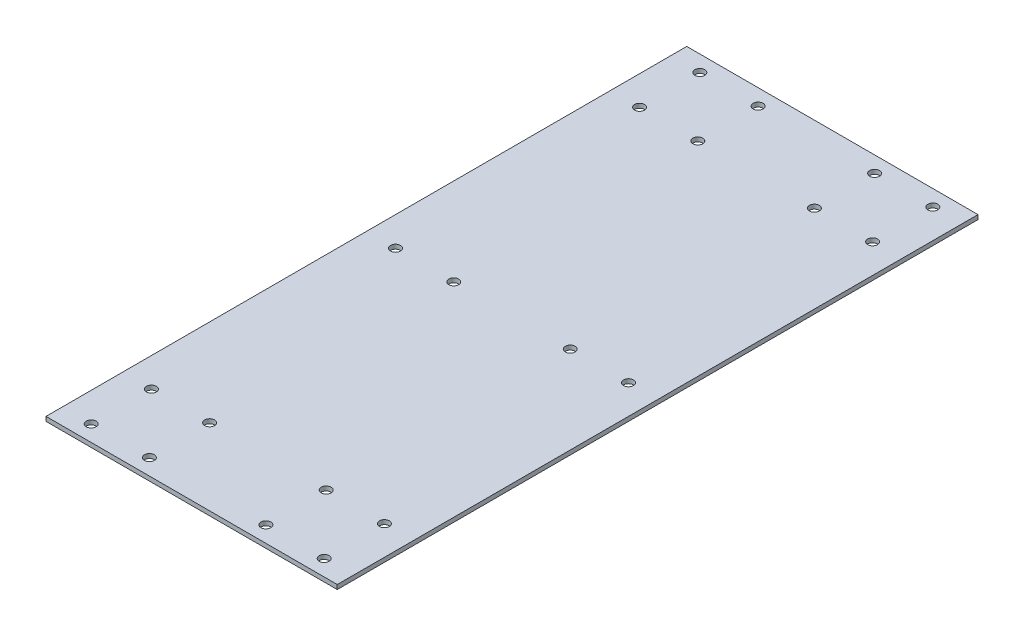
ISO-10303-21;
HEADER;
FILE_DESCRIPTION(('STEP AP214'),'2;1');
FILE_NAME('part.step','',(''),(''),'','','');
FILE_SCHEMA(('AUTOMOTIVE_DESIGN { 1 0 10303 214 1 1 1 1 }'));
ENDSEC;
DATA;
#1=APPLICATION_CONTEXT('core data for automotive mechanical design processes');
#2=APPLICATION_PROTOCOL_DEFINITION('international standard','automotive_design',2000,#1);
#3=PRODUCT_CONTEXT('',#1,'mechanical');
#4=PRODUCT('Part','Part','',(#3));
#5=PRODUCT_RELATED_PRODUCT_CATEGORY('part','',(#4));
#6=PRODUCT_DEFINITION_FORMATION('','',#4);
#7=PRODUCT_DEFINITION_CONTEXT('part definition',#1,'design');
#8=PRODUCT_DEFINITION('design','',#6,#7);
#9=PRODUCT_DEFINITION_SHAPE('','',#8);
#10=(LENGTH_UNIT() NAMED_UNIT(*) SI_UNIT(.MILLI.,.METRE.));
#11=(NAMED_UNIT(*) PLANE_ANGLE_UNIT() SI_UNIT($,.RADIAN.));
#12=(NAMED_UNIT(*) SI_UNIT($,.STERADIAN.) SOLID_ANGLE_UNIT());
#13=UNCERTAINTY_MEASURE_WITH_UNIT(LENGTH_MEASURE(1.E-05),#10,'distance_accuracy_value','');
#14=(GEOMETRIC_REPRESENTATION_CONTEXT(3) GLOBAL_UNCERTAINTY_ASSIGNED_CONTEXT((#13)) GLOBAL_UNIT_ASSIGNED_CONTEXT((#10,
#11,#12)) REPRESENTATION_CONTEXT('',''));
#15=CARTESIAN_POINT('',(0.,0.,0.));
#16=DIRECTION('',(0.,0.,1.));
#17=DIRECTION('',(1.,0.,0.));
#18=AXIS2_PLACEMENT_3D('',#15,#16,#17);
#19=CARTESIAN_POINT('',(-50.,46.95,-168.5));
#20=DIRECTION('',(-1.,0.,0.));
#21=DIRECTION('',(0.,0.,1.));
#22=AXIS2_PLACEMENT_3D('',#19,#20,#21);
#23=PLANE('',#22);
#24=DIRECTION('',(0.,-1.,0.));
#25=VECTOR('',#24,1.);
#26=CARTESIAN_POINT('',(-50.,46.95,51.5));
#27=LINE('',#26,#25);
#28=CARTESIAN_POINT('',(-50.,46.95,51.5));
#29=VERTEX_POINT('',#28);
#30=CARTESIAN_POINT('',(-50.,45.45,51.5));
#31=VERTEX_POINT('',#30);
#32=EDGE_CURVE('E87',#29,#31,#27,.T.);
#33=ORIENTED_EDGE('',*,*,#32,.F.);
#34=DIRECTION('',(0.,0.,1.));
#35=VECTOR('',#34,1.);
#36=CARTESIAN_POINT('',(-50.,46.95,-168.5));
#37=LINE('',#36,#35);
#38=CARTESIAN_POINT('',(-50.,46.95,-168.5));
#39=VERTEX_POINT('',#38);
#40=EDGE_CURVE('E59',#39,#29,#37,.T.);
#41=ORIENTED_EDGE('',*,*,#40,.F.);
#42=DIRECTION('',(0.,-1.,0.));
#43=VECTOR('',#42,1.);
#44=CARTESIAN_POINT('',(-50.,46.95,-168.5));
#45=LINE('',#44,#43);
#46=CARTESIAN_POINT('',(-50.,45.45,-168.5));
#47=VERTEX_POINT('',#46);
#48=EDGE_CURVE('E72',#39,#47,#45,.T.);
#49=ORIENTED_EDGE('',*,*,#48,.T.);
#50=DIRECTION('',(0.,0.,1.));
#51=VECTOR('',#50,1.);
#52=CARTESIAN_POINT('',(-50.,45.45,-168.5));
#53=LINE('',#52,#51);
#54=EDGE_CURVE('E11',#47,#31,#53,.T.);
#55=ORIENTED_EDGE('',*,*,#54,.T.);
#56=EDGE_LOOP('',(#33,#41,#49,#55));
#57=FACE_BOUND('',#56,.T.);
#58=ADVANCED_FACE('F17',(#57),#23,.T.);
#59=CARTESIAN_POINT('',(-46.3303607703069,45.45,-168.5));
#60=DIRECTION('',(0.,-1.,0.));
#61=DIRECTION('',(0.,0.,-1.));
#62=AXIS2_PLACEMENT_3D('',#59,#60,#61);
#63=PLANE('',#62);
#64=CARTESIAN_POINT('',(-40.,45.45,-142.303318982916));
#65=DIRECTION('',(0.,1.,0.));
#66=DIRECTION('',(0.,0.,1.));
#67=AXIS2_PLACEMENT_3D('',#64,#65,#66);
#68=CIRCLE('',#67,1.7);
#69=CARTESIAN_POINT('',(-40.,45.45,-140.603318982916));
#70=VERTEX_POINT('',#69);
#71=EDGE_CURVE('E131',#70,#70,#68,.T.);
#72=ORIENTED_EDGE('',*,*,#71,.T.);
#73=EDGE_LOOP('',(#72));
#74=FACE_BOUND('',#73,.T.);
#75=CARTESIAN_POINT('',(-20.,45.45,-142.303318982916));
#76=DIRECTION('',(0.,1.,0.));
#77=DIRECTION('',(0.,0.,1.));
#78=AXIS2_PLACEMENT_3D('',#75,#76,#77);
#79=CIRCLE('',#78,1.7);
#80=CARTESIAN_POINT('',(-20.,45.45,-140.603318982916));
#81=VERTEX_POINT('',#80);
#82=EDGE_CURVE('E121',#81,#81,#79,.T.);
#83=ORIENTED_EDGE('',*,*,#82,.T.);
#84=EDGE_LOOP('',(#83));
#85=FACE_BOUND('',#84,.T.);
#86=CARTESIAN_POINT('',(20.,45.45,-142.303318982916));
#87=DIRECTION('',(0.,1.,0.));
#88=DIRECTION('',(0.,0.,1.));
#89=AXIS2_PLACEMENT_3D('',#86,#87,#88);
#90=CIRCLE('',#89,1.7);
#91=CARTESIAN_POINT('',(20.,45.45,-140.603318982916));
#92=VERTEX_POINT('',#91);
#93=EDGE_CURVE('E118',#92,#92,#90,.T.);
#94=ORIENTED_EDGE('',*,*,#93,.T.);
#95=EDGE_LOOP('',(#94));
#96=FACE_BOUND('',#95,.T.);
#97=CARTESIAN_POINT('',(40.,45.45,-142.303318982916));
#98=DIRECTION('',(0.,1.,0.));
#99=DIRECTION('',(0.,0.,1.));
#100=AXIS2_PLACEMENT_3D('',#97,#98,#99);
#101=CIRCLE('',#100,1.7);
#102=CARTESIAN_POINT('',(40.,45.45,-140.603318982916));
#103=VERTEX_POINT('',#102);
#104=EDGE_CURVE('E115',#103,#103,#101,.T.);
#105=ORIENTED_EDGE('',*,*,#104,.T.);
#106=EDGE_LOOP('',(#105));
#107=FACE_BOUND('',#106,.T.);
#108=CARTESIAN_POINT('',(40.0000000000005,45.45,25.3033189828539));
#109=DIRECTION('',(0.,1.,0.));
#110=DIRECTION('',(0.,0.,1.));
#111=AXIS2_PLACEMENT_3D('',#108,#109,#110);
#112=CIRCLE('',#111,1.7);
#113=CARTESIAN_POINT('',(40.0000000000005,45.45,27.0033189828539));
#114=VERTEX_POINT('',#113);
#115=EDGE_CURVE('E111',#114,#114,#112,.T.);
#116=ORIENTED_EDGE('',*,*,#115,.T.);
#117=EDGE_LOOP('',(#116));
#118=FACE_BOUND('',#117,.T.);
#119=CARTESIAN_POINT('',(20.0000000000004,45.45,25.303318982854));
#120=DIRECTION('',(0.,1.,0.));
#121=DIRECTION('',(0.,0.,1.));
#122=AXIS2_PLACEMENT_3D('',#119,#120,#121);
#123=CIRCLE('',#122,1.7);
#124=CARTESIAN_POINT('',(20.0000000000004,45.45,27.003318982854));
#125=VERTEX_POINT('',#124);
#126=EDGE_CURVE('E107',#125,#125,#123,.T.);
#127=ORIENTED_EDGE('',*,*,#126,.T.);
#128=EDGE_LOOP('',(#127));
#129=FACE_BOUND('',#128,.T.);
#130=CARTESIAN_POINT('',(-20.,45.45,25.3033189828539));
#131=DIRECTION('',(0.,1.,0.));
#132=DIRECTION('',(0.,0.,1.));
#133=AXIS2_PLACEMENT_3D('',#130,#131,#132);
#134=CIRCLE('',#133,1.7);
#135=CARTESIAN_POINT('',(-20.,45.45,27.0033189828539));
#136=VERTEX_POINT('',#135);
#137=EDGE_CURVE('E103',#136,#136,#134,.T.);
#138=ORIENTED_EDGE('',*,*,#137,.T.);
#139=EDGE_LOOP('',(#138));
#140=FACE_BOUND('',#139,.T.);
#141=CARTESIAN_POINT('',(-40.,45.45,25.3033189828539));
#142=DIRECTION('',(0.,1.,0.));
#143=DIRECTION('',(0.,0.,1.));
#144=AXIS2_PLACEMENT_3D('',#141,#142,#143);
#145=CIRCLE('',#144,1.7);
#146=CARTESIAN_POINT('',(-40.,45.45,27.0033189828539));
#147=VERTEX_POINT('',#146);
#148=EDGE_CURVE('E99',#147,#147,#145,.T.);
#149=ORIENTED_EDGE('',*,*,#148,.T.);
#150=EDGE_LOOP('',(#149));
#151=FACE_BOUND('',#150,.T.);
#152=CARTESIAN_POINT('',(-40.,45.45,46.));
#153=DIRECTION('',(0.,-1.,0.));
#154=DIRECTION('',(0.,0.,-1.));
#155=AXIS2_PLACEMENT_3D('',#152,#153,#154);
#156=CIRCLE('',#155,1.7);
#157=CARTESIAN_POINT('',(-40.,45.45,44.3));
#158=VERTEX_POINT('',#157);
#159=EDGE_CURVE('E146',#158,#158,#156,.T.);
#160=ORIENTED_EDGE('',*,*,#159,.F.);
#161=EDGE_LOOP('',(#160));
#162=FACE_BOUND('',#161,.T.);
#163=CARTESIAN_POINT('',(-40.,45.45,-58.5));
#164=DIRECTION('',(0.,-1.,0.));
#165=DIRECTION('',(0.,0.,-1.));
#166=AXIS2_PLACEMENT_3D('',#163,#164,#165);
#167=CIRCLE('',#166,1.7);
#168=CARTESIAN_POINT('',(-40.,45.45,-60.2));
#169=VERTEX_POINT('',#168);
#170=EDGE_CURVE('E152',#169,#169,#167,.T.);
#171=ORIENTED_EDGE('',*,*,#170,.F.);
#172=EDGE_LOOP('',(#171));
#173=FACE_BOUND('',#172,.T.);
#174=CARTESIAN_POINT('',(-40.,45.45,-163.));
#175=DIRECTION('',(0.,-1.,0.));
#176=DIRECTION('',(0.,0.,-1.));
#177=AXIS2_PLACEMENT_3D('',#174,#175,#176);
#178=CIRCLE('',#177,1.7);
#179=CARTESIAN_POINT('',(-40.,45.45,-164.7));
#180=VERTEX_POINT('',#179);
#181=EDGE_CURVE('E158',#180,#180,#178,.T.);
#182=ORIENTED_EDGE('',*,*,#181,.F.);
#183=EDGE_LOOP('',(#182));
#184=FACE_BOUND('',#183,.T.);
#185=CARTESIAN_POINT('',(40.,45.45,-163.));
#186=DIRECTION('',(0.,-1.,0.));
#187=DIRECTION('',(0.,0.,-1.));
#188=AXIS2_PLACEMENT_3D('',#185,#186,#187);
#189=CIRCLE('',#188,1.7);
#190=CARTESIAN_POINT('',(40.,45.45,-164.7));
#191=VERTEX_POINT('',#190);
#192=EDGE_CURVE('E164',#191,#191,#189,.T.);
#193=ORIENTED_EDGE('',*,*,#192,.F.);
#194=EDGE_LOOP('',(#193));
#195=FACE_BOUND('',#194,.T.);
#196=CARTESIAN_POINT('',(40.,45.45,-58.5));
#197=DIRECTION('',(0.,-1.,0.));
#198=DIRECTION('',(0.,0.,-1.));
#199=AXIS2_PLACEMENT_3D('',#196,#197,#198);
#200=CIRCLE('',#199,1.7);
#201=CARTESIAN_POINT('',(40.,45.45,-60.2));
#202=VERTEX_POINT('',#201);
#203=EDGE_CURVE('E170',#202,#202,#200,.T.);
#204=ORIENTED_EDGE('',*,*,#203,.F.);
#205=EDGE_LOOP('',(#204));
#206=FACE_BOUND('',#205,.T.);
#207=CARTESIAN_POINT('',(40.,45.45,46.));
#208=DIRECTION('',(0.,-1.,0.));
#209=DIRECTION('',(0.,0.,-1.));
#210=AXIS2_PLACEMENT_3D('',#207,#208,#209);
#211=CIRCLE('',#210,1.7);
#212=CARTESIAN_POINT('',(40.,45.45,44.3));
#213=VERTEX_POINT('',#212);
#214=EDGE_CURVE('E176',#213,#213,#211,.T.);
#215=ORIENTED_EDGE('',*,*,#214,.F.);
#216=EDGE_LOOP('',(#215));
#217=FACE_BOUND('',#216,.T.);
#218=CARTESIAN_POINT('',(-20.,45.45,-163.));
#219=DIRECTION('',(0.,-1.,0.));
#220=DIRECTION('',(0.,0.,-1.));
#221=AXIS2_PLACEMENT_3D('',#218,#219,#220);
#222=CIRCLE('',#221,1.7);
#223=CARTESIAN_POINT('',(-20.,45.45,-164.7));
#224=VERTEX_POINT('',#223);
#225=EDGE_CURVE('E182',#224,#224,#222,.T.);
#226=ORIENTED_EDGE('',*,*,#225,.F.);
#227=EDGE_LOOP('',(#226));
#228=FACE_BOUND('',#227,.T.);
#229=CARTESIAN_POINT('',(20.,45.45,-163.));
#230=DIRECTION('',(0.,-1.,0.));
#231=DIRECTION('',(0.,0.,-1.));
#232=AXIS2_PLACEMENT_3D('',#229,#230,#231);
#233=CIRCLE('',#232,1.7);
#234=CARTESIAN_POINT('',(20.,45.45,-164.7));
#235=VERTEX_POINT('',#234);
#236=EDGE_CURVE('E188',#235,#235,#233,.T.);
#237=ORIENTED_EDGE('',*,*,#236,.F.);
#238=EDGE_LOOP('',(#237));
#239=FACE_BOUND('',#238,.T.);
#240=CARTESIAN_POINT('',(20.,45.45,-58.5));
#241=DIRECTION('',(0.,-1.,0.));
#242=DIRECTION('',(0.,0.,-1.));
#243=AXIS2_PLACEMENT_3D('',#240,#241,#242);
#244=CIRCLE('',#243,1.7);
#245=CARTESIAN_POINT('',(20.,45.45,-60.2));
#246=VERTEX_POINT('',#245);
#247=EDGE_CURVE('E194',#246,#246,#244,.T.);
#248=ORIENTED_EDGE('',*,*,#247,.F.);
#249=EDGE_LOOP('',(#248));
#250=FACE_BOUND('',#249,.T.);
#251=CARTESIAN_POINT('',(-20.,45.45,-58.5));
#252=DIRECTION('',(0.,-1.,0.));
#253=DIRECTION('',(0.,0.,-1.));
#254=AXIS2_PLACEMENT_3D('',#251,#252,#253);
#255=CIRCLE('',#254,1.7);
#256=CARTESIAN_POINT('',(-20.,45.45,-60.2));
#257=VERTEX_POINT('',#256);
#258=EDGE_CURVE('E200',#257,#257,#255,.T.);
#259=ORIENTED_EDGE('',*,*,#258,.F.);
#260=EDGE_LOOP('',(#259));
#261=FACE_BOUND('',#260,.T.);
#262=CARTESIAN_POINT('',(-20.,45.45,46.));
#263=DIRECTION('',(0.,-1.,0.));
#264=DIRECTION('',(0.,0.,-1.));
#265=AXIS2_PLACEMENT_3D('',#262,#263,#264);
#266=CIRCLE('',#265,1.7);
#267=CARTESIAN_POINT('',(-20.,45.45,44.3));
#268=VERTEX_POINT('',#267);
#269=EDGE_CURVE('E206',#268,#268,#266,.T.);
#270=ORIENTED_EDGE('',*,*,#269,.F.);
#271=EDGE_LOOP('',(#270));
#272=FACE_BOUND('',#271,.T.);
#273=CARTESIAN_POINT('',(20.,45.45,46.));
#274=DIRECTION('',(0.,-1.,0.));
#275=DIRECTION('',(0.,0.,-1.));
#276=AXIS2_PLACEMENT_3D('',#273,#274,#275);
#277=CIRCLE('',#276,1.7);
#278=CARTESIAN_POINT('',(20.,45.45,44.3));
#279=VERTEX_POINT('',#278);
#280=EDGE_CURVE('E81',#279,#279,#277,.T.);
#281=ORIENTED_EDGE('',*,*,#280,.F.);
#282=EDGE_LOOP('',(#281));
#283=FACE_BOUND('',#282,.T.);
#284=DIRECTION('',(1.,0.,0.));
#285=VECTOR('',#284,1.);
#286=CARTESIAN_POINT('',(-46.3303607703069,45.45,51.5));
#287=LINE('',#286,#285);
#288=CARTESIAN_POINT('',(50.,45.45,51.5));
#289=VERTEX_POINT('',#288);
#290=EDGE_CURVE('E65',#31,#289,#287,.T.);
#291=ORIENTED_EDGE('',*,*,#290,.F.);
#292=ORIENTED_EDGE('',*,*,#54,.F.);
#293=DIRECTION('',(1.,0.,0.));
#294=VECTOR('',#293,1.);
#295=CARTESIAN_POINT('',(-50.,45.45,-168.5));
#296=LINE('',#295,#294);
#297=CARTESIAN_POINT('',(50.,45.45,-168.5));
#298=VERTEX_POINT('',#297);
#299=EDGE_CURVE('E63',#47,#298,#296,.T.);
#300=ORIENTED_EDGE('',*,*,#299,.T.);
#301=DIRECTION('',(0.,0.,1.));
#302=VECTOR('',#301,1.);
#303=CARTESIAN_POINT('',(50.,45.45,-168.5));
#304=LINE('',#303,#302);
#305=EDGE_CURVE('E26',#298,#289,#304,.T.);
#306=ORIENTED_EDGE('',*,*,#305,.T.);
#307=EDGE_LOOP('',(#291,#292,#300,#306));
#308=FACE_BOUND('',#307,.T.);
#309=ADVANCED_FACE('F62',(#74,#85,#96,#107,#118,#129,#140,#151,#162,#173,#184,#195,#206,#217,
#228,#239,#250,#261,#272,#283,#308),#63,.T.);
#310=CARTESIAN_POINT('',(50.,45.45,-168.5));
#311=DIRECTION('',(1.,0.,0.));
#312=DIRECTION('',(0.,0.,-1.));
#313=AXIS2_PLACEMENT_3D('',#310,#311,#312);
#314=PLANE('',#313);
#315=DIRECTION('',(0.,1.,0.));
#316=VECTOR('',#315,1.);
#317=CARTESIAN_POINT('',(50.,45.45,51.5));
#318=LINE('',#317,#316);
#319=CARTESIAN_POINT('',(50.,46.95,51.5));
#320=VERTEX_POINT('',#319);
#321=EDGE_CURVE('E78',#289,#320,#318,.T.);
#322=ORIENTED_EDGE('',*,*,#321,.F.);
#323=ORIENTED_EDGE('',*,*,#305,.F.);
#324=DIRECTION('',(0.,1.,0.));
#325=VECTOR('',#324,1.);
#326=CARTESIAN_POINT('',(50.,45.45,-168.5));
#327=LINE('',#326,#325);
#328=CARTESIAN_POINT('',(50.,46.95,-168.5));
#329=VERTEX_POINT('',#328);
#330=EDGE_CURVE('E73',#298,#329,#327,.T.);
#331=ORIENTED_EDGE('',*,*,#330,.T.);
#332=DIRECTION('',(0.,0.,1.));
#333=VECTOR('',#332,1.);
#334=CARTESIAN_POINT('',(50.,46.95,-168.5));
#335=LINE('',#334,#333);
#336=EDGE_CURVE('E35',#329,#320,#335,.T.);
#337=ORIENTED_EDGE('',*,*,#336,.T.);
#338=EDGE_LOOP('',(#322,#323,#331,#337));
#339=FACE_BOUND('',#338,.T.);
#340=ADVANCED_FACE('F219',(#339),#314,.T.);
#341=CARTESIAN_POINT('',(50.,46.95,-168.5));
#342=DIRECTION('',(0.,1.,0.));
#343=DIRECTION('',(0.,0.,1.));
#344=AXIS2_PLACEMENT_3D('',#341,#342,#343);
#345=PLANE('',#344);
#346=CARTESIAN_POINT('',(-40.,46.95,-142.303318982916));
#347=DIRECTION('',(0.,1.,0.));
#348=DIRECTION('',(0.,0.,1.));
#349=AXIS2_PLACEMENT_3D('',#346,#347,#348);
#350=CIRCLE('',#349,1.7);
#351=CARTESIAN_POINT('',(-40.,46.95,-140.603318982916));
#352=VERTEX_POINT('',#351);
#353=EDGE_CURVE('E20',#352,#352,#350,.T.);
#354=ORIENTED_EDGE('',*,*,#353,.F.);
#355=EDGE_LOOP('',(#354));
#356=FACE_BOUND('',#355,.T.);
#357=CARTESIAN_POINT('',(-20.,46.95,-142.303318982916));
#358=DIRECTION('',(0.,1.,0.));
#359=DIRECTION('',(0.,0.,1.));
#360=AXIS2_PLACEMENT_3D('',#357,#358,#359);
#361=CIRCLE('',#360,1.7);
#362=CARTESIAN_POINT('',(-20.,46.95,-140.603318982916));
#363=VERTEX_POINT('',#362);
#364=EDGE_CURVE('E119',#363,#363,#361,.T.);
#365=ORIENTED_EDGE('',*,*,#364,.F.);
#366=EDGE_LOOP('',(#365));
#367=FACE_BOUND('',#366,.T.);
#368=CARTESIAN_POINT('',(20.,46.95,-142.303318982916));
#369=DIRECTION('',(0.,1.,0.));
#370=DIRECTION('',(0.,0.,1.));
#371=AXIS2_PLACEMENT_3D('',#368,#369,#370);
#372=CIRCLE('',#371,1.7);
#373=CARTESIAN_POINT('',(20.,46.95,-140.603318982916));
#374=VERTEX_POINT('',#373);
#375=EDGE_CURVE('E116',#374,#374,#372,.T.);
#376=ORIENTED_EDGE('',*,*,#375,.F.);
#377=EDGE_LOOP('',(#376));
#378=FACE_BOUND('',#377,.T.);
#379=CARTESIAN_POINT('',(40.,46.95,-142.303318982916));
#380=DIRECTION('',(0.,1.,0.));
#381=DIRECTION('',(0.,0.,1.));
#382=AXIS2_PLACEMENT_3D('',#379,#380,#381);
#383=CIRCLE('',#382,1.7);
#384=CARTESIAN_POINT('',(40.,46.95,-140.603318982916));
#385=VERTEX_POINT('',#384);
#386=EDGE_CURVE('E112',#385,#385,#383,.T.);
#387=ORIENTED_EDGE('',*,*,#386,.F.);
#388=EDGE_LOOP('',(#387));
#389=FACE_BOUND('',#388,.T.);
#390=CARTESIAN_POINT('',(40.0000000000005,46.95,25.3033189828539));
#391=DIRECTION('',(0.,1.,0.));
#392=DIRECTION('',(0.,0.,1.));
#393=AXIS2_PLACEMENT_3D('',#390,#391,#392);
#394=CIRCLE('',#393,1.7);
#395=CARTESIAN_POINT('',(40.0000000000005,46.95,27.0033189828539));
#396=VERTEX_POINT('',#395);
#397=EDGE_CURVE('E108',#396,#396,#394,.T.);
#398=ORIENTED_EDGE('',*,*,#397,.F.);
#399=EDGE_LOOP('',(#398));
#400=FACE_BOUND('',#399,.T.);
#401=CARTESIAN_POINT('',(20.0000000000004,46.95,25.303318982854));
#402=DIRECTION('',(0.,1.,0.));
#403=DIRECTION('',(0.,0.,1.));
#404=AXIS2_PLACEMENT_3D('',#401,#402,#403);
#405=CIRCLE('',#404,1.7);
#406=CARTESIAN_POINT('',(20.0000000000004,46.95,27.003318982854));
#407=VERTEX_POINT('',#406);
#408=EDGE_CURVE('E104',#407,#407,#405,.T.);
#409=ORIENTED_EDGE('',*,*,#408,.F.);
#410=EDGE_LOOP('',(#409));
#411=FACE_BOUND('',#410,.T.);
#412=CARTESIAN_POINT('',(-20.,46.95,25.3033189828539));
#413=DIRECTION('',(0.,1.,0.));
#414=DIRECTION('',(0.,0.,1.));
#415=AXIS2_PLACEMENT_3D('',#412,#413,#414);
#416=CIRCLE('',#415,1.7);
#417=CARTESIAN_POINT('',(-20.,46.95,27.0033189828539));
#418=VERTEX_POINT('',#417);
#419=EDGE_CURVE('E100',#418,#418,#416,.T.);
#420=ORIENTED_EDGE('',*,*,#419,.F.);
#421=EDGE_LOOP('',(#420));
#422=FACE_BOUND('',#421,.T.);
#423=CARTESIAN_POINT('',(-40.,46.95,25.3033189828539));
#424=DIRECTION('',(0.,1.,0.));
#425=DIRECTION('',(0.,0.,1.));
#426=AXIS2_PLACEMENT_3D('',#423,#424,#425);
#427=CIRCLE('',#426,1.7);
#428=CARTESIAN_POINT('',(-40.,46.95,27.0033189828539));
#429=VERTEX_POINT('',#428);
#430=EDGE_CURVE('E95',#429,#429,#427,.T.);
#431=ORIENTED_EDGE('',*,*,#430,.F.);
#432=EDGE_LOOP('',(#431));
#433=FACE_BOUND('',#432,.T.);
#434=CARTESIAN_POINT('',(-40.,46.95,46.));
#435=DIRECTION('',(0.,-1.,0.));
#436=DIRECTION('',(0.,0.,-1.));
#437=AXIS2_PLACEMENT_3D('',#434,#435,#436);
#438=CIRCLE('',#437,1.7);
#439=CARTESIAN_POINT('',(-40.,46.95,44.3));
#440=VERTEX_POINT('',#439);
#441=EDGE_CURVE('E98',#440,#440,#438,.T.);
#442=ORIENTED_EDGE('',*,*,#441,.T.);
#443=EDGE_LOOP('',(#442));
#444=FACE_BOUND('',#443,.T.);
#445=CARTESIAN_POINT('',(-40.,46.95,-58.5));
#446=DIRECTION('',(0.,-1.,0.));
#447=DIRECTION('',(0.,0.,-1.));
#448=AXIS2_PLACEMENT_3D('',#445,#446,#447);
#449=CIRCLE('',#448,1.7);
#450=CARTESIAN_POINT('',(-40.,46.95,-60.2));
#451=VERTEX_POINT('',#450);
#452=EDGE_CURVE('E149',#451,#451,#449,.T.);
#453=ORIENTED_EDGE('',*,*,#452,.T.);
#454=EDGE_LOOP('',(#453));
#455=FACE_BOUND('',#454,.T.);
#456=CARTESIAN_POINT('',(-40.,46.95,-163.));
#457=DIRECTION('',(0.,-1.,0.));
#458=DIRECTION('',(0.,0.,-1.));
#459=AXIS2_PLACEMENT_3D('',#456,#457,#458);
#460=CIRCLE('',#459,1.7);
#461=CARTESIAN_POINT('',(-40.,46.95,-164.7));
#462=VERTEX_POINT('',#461);
#463=EDGE_CURVE('E155',#462,#462,#460,.T.);
#464=ORIENTED_EDGE('',*,*,#463,.T.);
#465=EDGE_LOOP('',(#464));
#466=FACE_BOUND('',#465,.T.);
#467=CARTESIAN_POINT('',(40.,46.95,-163.));
#468=DIRECTION('',(0.,-1.,0.));
#469=DIRECTION('',(0.,0.,-1.));
#470=AXIS2_PLACEMENT_3D('',#467,#468,#469);
#471=CIRCLE('',#470,1.7);
#472=CARTESIAN_POINT('',(40.,46.95,-164.7));
#473=VERTEX_POINT('',#472);
#474=EDGE_CURVE('E161',#473,#473,#471,.T.);
#475=ORIENTED_EDGE('',*,*,#474,.T.);
#476=EDGE_LOOP('',(#475));
#477=FACE_BOUND('',#476,.T.);
#478=CARTESIAN_POINT('',(40.,46.95,-58.5));
#479=DIRECTION('',(0.,-1.,0.));
#480=DIRECTION('',(0.,0.,-1.));
#481=AXIS2_PLACEMENT_3D('',#478,#479,#480);
#482=CIRCLE('',#481,1.7);
#483=CARTESIAN_POINT('',(40.,46.95,-60.2));
#484=VERTEX_POINT('',#483);
#485=EDGE_CURVE('E167',#484,#484,#482,.T.);
#486=ORIENTED_EDGE('',*,*,#485,.T.);
#487=EDGE_LOOP('',(#486));
#488=FACE_BOUND('',#487,.T.);
#489=CARTESIAN_POINT('',(40.,46.95,46.));
#490=DIRECTION('',(0.,-1.,0.));
#491=DIRECTION('',(0.,0.,-1.));
#492=AXIS2_PLACEMENT_3D('',#489,#490,#491);
#493=CIRCLE('',#492,1.7);
#494=CARTESIAN_POINT('',(40.,46.95,44.3));
#495=VERTEX_POINT('',#494);
#496=EDGE_CURVE('E173',#495,#495,#493,.T.);
#497=ORIENTED_EDGE('',*,*,#496,.T.);
#498=EDGE_LOOP('',(#497));
#499=FACE_BOUND('',#498,.T.);
#500=CARTESIAN_POINT('',(-20.,46.95,-163.));
#501=DIRECTION('',(0.,-1.,0.));
#502=DIRECTION('',(0.,0.,-1.));
#503=AXIS2_PLACEMENT_3D('',#500,#501,#502);
#504=CIRCLE('',#503,1.7);
#505=CARTESIAN_POINT('',(-20.,46.95,-164.7));
#506=VERTEX_POINT('',#505);
#507=EDGE_CURVE('E179',#506,#506,#504,.T.);
#508=ORIENTED_EDGE('',*,*,#507,.T.);
#509=EDGE_LOOP('',(#508));
#510=FACE_BOUND('',#509,.T.);
#511=CARTESIAN_POINT('',(20.,46.95,-163.));
#512=DIRECTION('',(0.,-1.,0.));
#513=DIRECTION('',(0.,0.,-1.));
#514=AXIS2_PLACEMENT_3D('',#511,#512,#513);
#515=CIRCLE('',#514,1.7);
#516=CARTESIAN_POINT('',(20.,46.95,-164.7));
#517=VERTEX_POINT('',#516);
#518=EDGE_CURVE('E185',#517,#517,#515,.T.);
#519=ORIENTED_EDGE('',*,*,#518,.T.);
#520=EDGE_LOOP('',(#519));
#521=FACE_BOUND('',#520,.T.);
#522=CARTESIAN_POINT('',(20.,46.95,-58.5));
#523=DIRECTION('',(0.,-1.,0.));
#524=DIRECTION('',(0.,0.,-1.));
#525=AXIS2_PLACEMENT_3D('',#522,#523,#524);
#526=CIRCLE('',#525,1.7);
#527=CARTESIAN_POINT('',(20.,46.95,-60.2));
#528=VERTEX_POINT('',#527);
#529=EDGE_CURVE('E191',#528,#528,#526,.T.);
#530=ORIENTED_EDGE('',*,*,#529,.T.);
#531=EDGE_LOOP('',(#530));
#532=FACE_BOUND('',#531,.T.);
#533=CARTESIAN_POINT('',(-20.,46.95,-58.5));
#534=DIRECTION('',(0.,-1.,0.));
#535=DIRECTION('',(0.,0.,-1.));
#536=AXIS2_PLACEMENT_3D('',#533,#534,#535);
#537=CIRCLE('',#536,1.7);
#538=CARTESIAN_POINT('',(-20.,46.95,-60.2));
#539=VERTEX_POINT('',#538);
#540=EDGE_CURVE('E197',#539,#539,#537,.T.);
#541=ORIENTED_EDGE('',*,*,#540,.T.);
#542=EDGE_LOOP('',(#541));
#543=FACE_BOUND('',#542,.T.);
#544=CARTESIAN_POINT('',(-20.,46.95,46.));
#545=DIRECTION('',(0.,-1.,0.));
#546=DIRECTION('',(0.,0.,-1.));
#547=AXIS2_PLACEMENT_3D('',#544,#545,#546);
#548=CIRCLE('',#547,1.7);
#549=CARTESIAN_POINT('',(-20.,46.95,44.3));
#550=VERTEX_POINT('',#549);
#551=EDGE_CURVE('E203',#550,#550,#548,.T.);
#552=ORIENTED_EDGE('',*,*,#551,.T.);
#553=EDGE_LOOP('',(#552));
#554=FACE_BOUND('',#553,.T.);
#555=CARTESIAN_POINT('',(20.,46.95,46.));
#556=DIRECTION('',(0.,-1.,0.));
#557=DIRECTION('',(0.,0.,-1.));
#558=AXIS2_PLACEMENT_3D('',#555,#556,#557);
#559=CIRCLE('',#558,1.7);
#560=CARTESIAN_POINT('',(20.,46.95,44.3));
#561=VERTEX_POINT('',#560);
#562=EDGE_CURVE('E208',#561,#561,#559,.T.);
#563=ORIENTED_EDGE('',*,*,#562,.T.);
#564=EDGE_LOOP('',(#563));
#565=FACE_BOUND('',#564,.T.);
#566=DIRECTION('',(-1.,0.,0.));
#567=VECTOR('',#566,1.);
#568=CARTESIAN_POINT('',(50.,46.95,51.5));
#569=LINE('',#568,#567);
#570=EDGE_CURVE('E75',#320,#29,#569,.T.);
#571=ORIENTED_EDGE('',*,*,#570,.F.);
#572=ORIENTED_EDGE('',*,*,#336,.F.);
#573=DIRECTION('',(-1.,0.,0.));
#574=VECTOR('',#573,1.);
#575=CARTESIAN_POINT('',(50.,46.95,-168.5));
#576=LINE('',#575,#574);
#577=EDGE_CURVE('E85',#329,#39,#576,.T.);
#578=ORIENTED_EDGE('',*,*,#577,.T.);
#579=ORIENTED_EDGE('',*,*,#40,.T.);
#580=EDGE_LOOP('',(#571,#572,#578,#579));
#581=FACE_BOUND('',#580,.T.);
#582=ADVANCED_FACE('F226',(#356,#367,#378,#389,#400,#411,#422,#433,#444,#455,#466,#477,#488,
#499,#510,#521,#532,#543,#554,#565,#581),#345,.T.);
#583=CARTESIAN_POINT('',(0.,0.,-168.5));
#584=DIRECTION('',(0.,0.,1.));
#585=DIRECTION('',(1.,0.,0.));
#586=AXIS2_PLACEMENT_3D('',#583,#584,#585);
#587=PLANE('',#586);
#588=ORIENTED_EDGE('',*,*,#48,.F.);
#589=ORIENTED_EDGE('',*,*,#577,.F.);
#590=ORIENTED_EDGE('',*,*,#330,.F.);
#591=ORIENTED_EDGE('',*,*,#299,.F.);
#592=EDGE_LOOP('',(#588,#589,#590,#591));
#593=FACE_BOUND('',#592,.T.);
#594=ADVANCED_FACE('F70',(#593),#587,.F.);
#595=CARTESIAN_POINT('',(0.,0.,51.5));
#596=DIRECTION('',(0.,0.,1.));
#597=DIRECTION('',(1.,0.,0.));
#598=AXIS2_PLACEMENT_3D('',#595,#596,#597);
#599=PLANE('',#598);
#600=ORIENTED_EDGE('',*,*,#32,.T.);
#601=ORIENTED_EDGE('',*,*,#290,.T.);
#602=ORIENTED_EDGE('',*,*,#321,.T.);
#603=ORIENTED_EDGE('',*,*,#570,.T.);
#604=EDGE_LOOP('',(#600,#601,#602,#603));
#605=FACE_BOUND('',#604,.T.);
#606=ADVANCED_FACE('F233',(#605),#599,.T.);
#607=CARTESIAN_POINT('',(20.,46.95,46.));
#608=DIRECTION('',(0.,-1.,0.));
#609=DIRECTION('',(0.,0.,-1.));
#610=AXIS2_PLACEMENT_3D('',#607,#608,#609);
#611=CYLINDRICAL_SURFACE('',#610,1.7);
#612=ORIENTED_EDGE('',*,*,#280,.T.);
#613=EDGE_LOOP('',(#612));
#614=FACE_BOUND('',#613,.T.);
#615=ORIENTED_EDGE('',*,*,#562,.F.);
#616=EDGE_LOOP('',(#615));
#617=FACE_BOUND('',#616,.T.);
#618=ADVANCED_FACE('F215',(#614,#617),#611,.F.);
#619=CARTESIAN_POINT('',(-20.,46.95,46.));
#620=DIRECTION('',(0.,-1.,0.));
#621=DIRECTION('',(0.,0.,-1.));
#622=AXIS2_PLACEMENT_3D('',#619,#620,#621);
#623=CYLINDRICAL_SURFACE('',#622,1.7);
#624=ORIENTED_EDGE('',*,*,#269,.T.);
#625=EDGE_LOOP('',(#624));
#626=FACE_BOUND('',#625,.T.);
#627=ORIENTED_EDGE('',*,*,#551,.F.);
#628=EDGE_LOOP('',(#627));
#629=FACE_BOUND('',#628,.T.);
#630=ADVANCED_FACE('F241',(#626,#629),#623,.F.);
#631=CARTESIAN_POINT('',(-20.,46.95,-58.5));
#632=DIRECTION('',(0.,-1.,0.));
#633=DIRECTION('',(0.,0.,-1.));
#634=AXIS2_PLACEMENT_3D('',#631,#632,#633);
#635=CYLINDRICAL_SURFACE('',#634,1.7);
#636=ORIENTED_EDGE('',*,*,#258,.T.);
#637=EDGE_LOOP('',(#636));
#638=FACE_BOUND('',#637,.T.);
#639=ORIENTED_EDGE('',*,*,#540,.F.);
#640=EDGE_LOOP('',(#639));
#641=FACE_BOUND('',#640,.T.);
#642=ADVANCED_FACE('F244',(#638,#641),#635,.F.);
#643=CARTESIAN_POINT('',(20.,46.95,-58.5));
#644=DIRECTION('',(0.,-1.,0.));
#645=DIRECTION('',(0.,0.,-1.));
#646=AXIS2_PLACEMENT_3D('',#643,#644,#645);
#647=CYLINDRICAL_SURFACE('',#646,1.7);
#648=ORIENTED_EDGE('',*,*,#247,.T.);
#649=EDGE_LOOP('',(#648));
#650=FACE_BOUND('',#649,.T.);
#651=ORIENTED_EDGE('',*,*,#529,.F.);
#652=EDGE_LOOP('',(#651));
#653=FACE_BOUND('',#652,.T.);
#654=ADVANCED_FACE('F248',(#650,#653),#647,.F.);
#655=CARTESIAN_POINT('',(20.,46.95,-163.));
#656=DIRECTION('',(0.,-1.,0.));
#657=DIRECTION('',(0.,0.,-1.));
#658=AXIS2_PLACEMENT_3D('',#655,#656,#657);
#659=CYLINDRICAL_SURFACE('',#658,1.7);
#660=ORIENTED_EDGE('',*,*,#236,.T.);
#661=EDGE_LOOP('',(#660));
#662=FACE_BOUND('',#661,.T.);
#663=ORIENTED_EDGE('',*,*,#518,.F.);
#664=EDGE_LOOP('',(#663));
#665=FACE_BOUND('',#664,.T.);
#666=ADVANCED_FACE('F252',(#662,#665),#659,.F.);
#667=CARTESIAN_POINT('',(-20.,46.95,-163.));
#668=DIRECTION('',(0.,-1.,0.));
#669=DIRECTION('',(0.,0.,-1.));
#670=AXIS2_PLACEMENT_3D('',#667,#668,#669);
#671=CYLINDRICAL_SURFACE('',#670,1.7);
#672=ORIENTED_EDGE('',*,*,#225,.T.);
#673=EDGE_LOOP('',(#672));
#674=FACE_BOUND('',#673,.T.);
#675=ORIENTED_EDGE('',*,*,#507,.F.);
#676=EDGE_LOOP('',(#675));
#677=FACE_BOUND('',#676,.T.);
#678=ADVANCED_FACE('F256',(#674,#677),#671,.F.);
#679=CARTESIAN_POINT('',(40.,46.95,46.));
#680=DIRECTION('',(0.,-1.,0.));
#681=DIRECTION('',(0.,0.,-1.));
#682=AXIS2_PLACEMENT_3D('',#679,#680,#681);
#683=CYLINDRICAL_SURFACE('',#682,1.7);
#684=ORIENTED_EDGE('',*,*,#214,.T.);
#685=EDGE_LOOP('',(#684));
#686=FACE_BOUND('',#685,.T.);
#687=ORIENTED_EDGE('',*,*,#496,.F.);
#688=EDGE_LOOP('',(#687));
#689=FACE_BOUND('',#688,.T.);
#690=ADVANCED_FACE('F260',(#686,#689),#683,.F.);
#691=CARTESIAN_POINT('',(40.,46.95,-58.5));
#692=DIRECTION('',(0.,-1.,0.));
#693=DIRECTION('',(0.,0.,-1.));
#694=AXIS2_PLACEMENT_3D('',#691,#692,#693);
#695=CYLINDRICAL_SURFACE('',#694,1.7);
#696=ORIENTED_EDGE('',*,*,#203,.T.);
#697=EDGE_LOOP('',(#696));
#698=FACE_BOUND('',#697,.T.);
#699=ORIENTED_EDGE('',*,*,#485,.F.);
#700=EDGE_LOOP('',(#699));
#701=FACE_BOUND('',#700,.T.);
#702=ADVANCED_FACE('F264',(#698,#701),#695,.F.);
#703=CARTESIAN_POINT('',(40.,46.95,-163.));
#704=DIRECTION('',(0.,-1.,0.));
#705=DIRECTION('',(0.,0.,-1.));
#706=AXIS2_PLACEMENT_3D('',#703,#704,#705);
#707=CYLINDRICAL_SURFACE('',#706,1.7);
#708=ORIENTED_EDGE('',*,*,#192,.T.);
#709=EDGE_LOOP('',(#708));
#710=FACE_BOUND('',#709,.T.);
#711=ORIENTED_EDGE('',*,*,#474,.F.);
#712=EDGE_LOOP('',(#711));
#713=FACE_BOUND('',#712,.T.);
#714=ADVANCED_FACE('F268',(#710,#713),#707,.F.);
#715=CARTESIAN_POINT('',(-40.,46.95,-163.));
#716=DIRECTION('',(0.,-1.,0.));
#717=DIRECTION('',(0.,0.,-1.));
#718=AXIS2_PLACEMENT_3D('',#715,#716,#717);
#719=CYLINDRICAL_SURFACE('',#718,1.7);
#720=ORIENTED_EDGE('',*,*,#181,.T.);
#721=EDGE_LOOP('',(#720));
#722=FACE_BOUND('',#721,.T.);
#723=ORIENTED_EDGE('',*,*,#463,.F.);
#724=EDGE_LOOP('',(#723));
#725=FACE_BOUND('',#724,.T.);
#726=ADVANCED_FACE('F272',(#722,#725),#719,.F.);
#727=CARTESIAN_POINT('',(-40.,46.95,-58.5));
#728=DIRECTION('',(0.,-1.,0.));
#729=DIRECTION('',(0.,0.,-1.));
#730=AXIS2_PLACEMENT_3D('',#727,#728,#729);
#731=CYLINDRICAL_SURFACE('',#730,1.7);
#732=ORIENTED_EDGE('',*,*,#170,.T.);
#733=EDGE_LOOP('',(#732));
#734=FACE_BOUND('',#733,.T.);
#735=ORIENTED_EDGE('',*,*,#452,.F.);
#736=EDGE_LOOP('',(#735));
#737=FACE_BOUND('',#736,.T.);
#738=ADVANCED_FACE('F276',(#734,#737),#731,.F.);
#739=CARTESIAN_POINT('',(-40.,46.95,46.));
#740=DIRECTION('',(0.,-1.,0.));
#741=DIRECTION('',(0.,0.,-1.));
#742=AXIS2_PLACEMENT_3D('',#739,#740,#741);
#743=CYLINDRICAL_SURFACE('',#742,1.7);
#744=ORIENTED_EDGE('',*,*,#159,.T.);
#745=EDGE_LOOP('',(#744));
#746=FACE_BOUND('',#745,.T.);
#747=ORIENTED_EDGE('',*,*,#441,.F.);
#748=EDGE_LOOP('',(#747));
#749=FACE_BOUND('',#748,.T.);
#750=ADVANCED_FACE('F280',(#746,#749),#743,.F.);
#751=CARTESIAN_POINT('',(-40.,45.45,25.3033189828539));
#752=DIRECTION('',(0.,1.,0.));
#753=DIRECTION('',(0.,0.,1.));
#754=AXIS2_PLACEMENT_3D('',#751,#752,#753);
#755=CYLINDRICAL_SURFACE('',#754,1.7);
#756=ORIENTED_EDGE('',*,*,#430,.T.);
#757=EDGE_LOOP('',(#756));
#758=FACE_BOUND('',#757,.T.);
#759=ORIENTED_EDGE('',*,*,#148,.F.);
#760=EDGE_LOOP('',(#759));
#761=FACE_BOUND('',#760,.T.);
#762=ADVANCED_FACE('F284',(#758,#761),#755,.F.);
#763=CARTESIAN_POINT('',(-20.,45.45,25.3033189828539));
#764=DIRECTION('',(0.,1.,0.));
#765=DIRECTION('',(0.,0.,1.));
#766=AXIS2_PLACEMENT_3D('',#763,#764,#765);
#767=CYLINDRICAL_SURFACE('',#766,1.7);
#768=ORIENTED_EDGE('',*,*,#419,.T.);
#769=EDGE_LOOP('',(#768));
#770=FACE_BOUND('',#769,.T.);
#771=ORIENTED_EDGE('',*,*,#137,.F.);
#772=EDGE_LOOP('',(#771));
#773=FACE_BOUND('',#772,.T.);
#774=ADVANCED_FACE('F288',(#770,#773),#767,.F.);
#775=CARTESIAN_POINT('',(20.0000000000004,45.45,25.303318982854));
#776=DIRECTION('',(0.,1.,0.));
#777=DIRECTION('',(0.,0.,1.));
#778=AXIS2_PLACEMENT_3D('',#775,#776,#777);
#779=CYLINDRICAL_SURFACE('',#778,1.7);
#780=ORIENTED_EDGE('',*,*,#408,.T.);
#781=EDGE_LOOP('',(#780));
#782=FACE_BOUND('',#781,.T.);
#783=ORIENTED_EDGE('',*,*,#126,.F.);
#784=EDGE_LOOP('',(#783));
#785=FACE_BOUND('',#784,.T.);
#786=ADVANCED_FACE('F292',(#782,#785),#779,.F.);
#787=CARTESIAN_POINT('',(40.0000000000005,45.45,25.3033189828539));
#788=DIRECTION('',(0.,1.,0.));
#789=DIRECTION('',(0.,0.,1.));
#790=AXIS2_PLACEMENT_3D('',#787,#788,#789);
#791=CYLINDRICAL_SURFACE('',#790,1.7);
#792=ORIENTED_EDGE('',*,*,#397,.T.);
#793=EDGE_LOOP('',(#792));
#794=FACE_BOUND('',#793,.T.);
#795=ORIENTED_EDGE('',*,*,#115,.F.);
#796=EDGE_LOOP('',(#795));
#797=FACE_BOUND('',#796,.T.);
#798=ADVANCED_FACE('F296',(#794,#797),#791,.F.);
#799=CARTESIAN_POINT('',(40.,45.45,-142.303318982916));
#800=DIRECTION('',(0.,1.,0.));
#801=DIRECTION('',(0.,0.,1.));
#802=AXIS2_PLACEMENT_3D('',#799,#800,#801);
#803=CYLINDRICAL_SURFACE('',#802,1.7);
#804=ORIENTED_EDGE('',*,*,#386,.T.);
#805=EDGE_LOOP('',(#804));
#806=FACE_BOUND('',#805,.T.);
#807=ORIENTED_EDGE('',*,*,#104,.F.);
#808=EDGE_LOOP('',(#807));
#809=FACE_BOUND('',#808,.T.);
#810=ADVANCED_FACE('F300',(#806,#809),#803,.F.);
#811=CARTESIAN_POINT('',(20.,45.45,-142.303318982916));
#812=DIRECTION('',(0.,1.,0.));
#813=DIRECTION('',(0.,0.,1.));
#814=AXIS2_PLACEMENT_3D('',#811,#812,#813);
#815=CYLINDRICAL_SURFACE('',#814,1.7);
#816=ORIENTED_EDGE('',*,*,#375,.T.);
#817=EDGE_LOOP('',(#816));
#818=FACE_BOUND('',#817,.T.);
#819=ORIENTED_EDGE('',*,*,#93,.F.);
#820=EDGE_LOOP('',(#819));
#821=FACE_BOUND('',#820,.T.);
#822=ADVANCED_FACE('F304',(#818,#821),#815,.F.);
#823=CARTESIAN_POINT('',(-20.,45.45,-142.303318982916));
#824=DIRECTION('',(0.,1.,0.));
#825=DIRECTION('',(0.,0.,1.));
#826=AXIS2_PLACEMENT_3D('',#823,#824,#825);
#827=CYLINDRICAL_SURFACE('',#826,1.7);
#828=ORIENTED_EDGE('',*,*,#364,.T.);
#829=EDGE_LOOP('',(#828));
#830=FACE_BOUND('',#829,.T.);
#831=ORIENTED_EDGE('',*,*,#82,.F.);
#832=EDGE_LOOP('',(#831));
#833=FACE_BOUND('',#832,.T.);
#834=ADVANCED_FACE('F308',(#830,#833),#827,.F.);
#835=CARTESIAN_POINT('',(-40.,45.45,-142.303318982916));
#836=DIRECTION('',(0.,1.,0.));
#837=DIRECTION('',(0.,0.,1.));
#838=AXIS2_PLACEMENT_3D('',#835,#836,#837);
#839=CYLINDRICAL_SURFACE('',#838,1.7);
#840=ORIENTED_EDGE('',*,*,#353,.T.);
#841=EDGE_LOOP('',(#840));
#842=FACE_BOUND('',#841,.T.);
#843=ORIENTED_EDGE('',*,*,#71,.F.);
#844=EDGE_LOOP('',(#843));
#845=FACE_BOUND('',#844,.T.);
#846=ADVANCED_FACE('F312',(#842,#845),#839,.F.);
#847=CLOSED_SHELL('',(#58,#309,#340,#582,#594,#606,#618,#630,#642,#654,#666,#678,#690,#702,#714,
#726,#738,#750,#762,#774,#786,#798,#810,#822,#834,#846));
#848=MANIFOLD_SOLID_BREP('B1',#847);
#849=ADVANCED_BREP_SHAPE_REPRESENTATION('',(#18,#848),#14);
#850=SHAPE_DEFINITION_REPRESENTATION(#9,#849);
ENDSEC;
END-ISO-10303-21;
